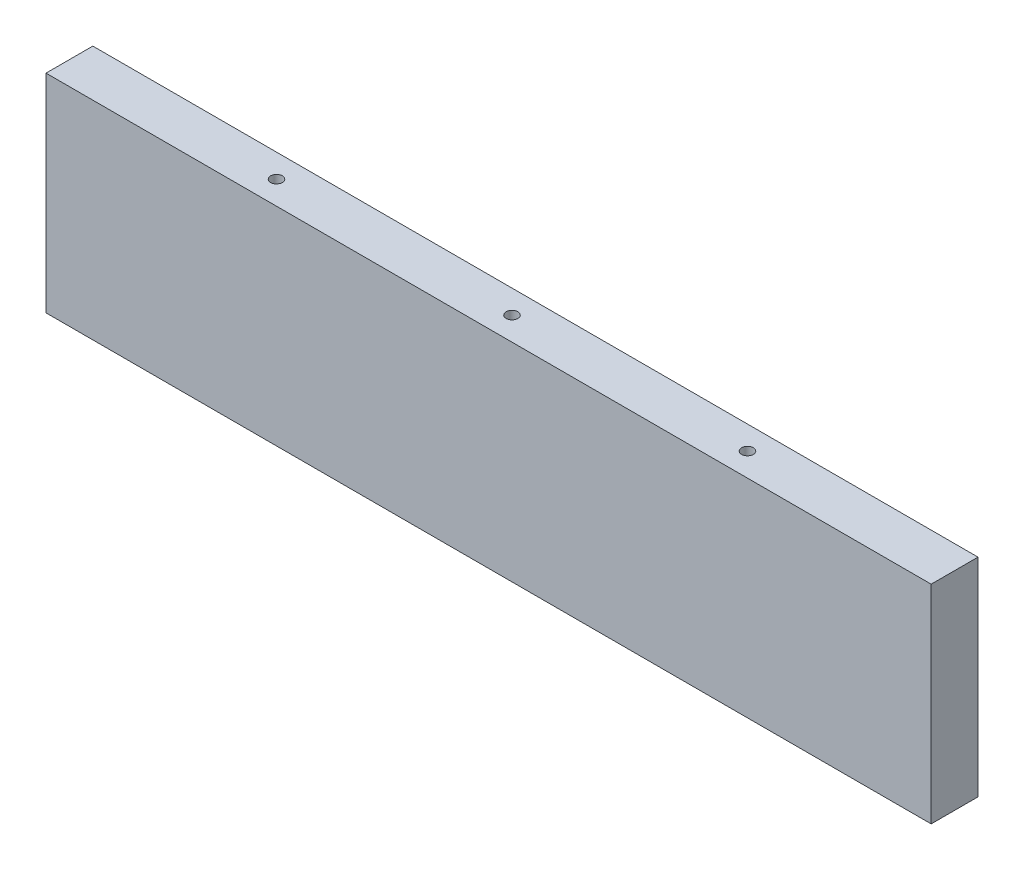
ISO-10303-21;
HEADER;
FILE_DESCRIPTION(('STEP AP214'),'2;1');
FILE_NAME('part.step','',(''),(''),'','','');
FILE_SCHEMA(('AUTOMOTIVE_DESIGN { 1 0 10303 214 1 1 1 1 }'));
ENDSEC;
DATA;
#1=APPLICATION_CONTEXT('core data for automotive mechanical design processes');
#2=APPLICATION_PROTOCOL_DEFINITION('international standard','automotive_design',2000,#1);
#3=PRODUCT_CONTEXT('',#1,'mechanical');
#4=PRODUCT('Part','Part','',(#3));
#5=PRODUCT_RELATED_PRODUCT_CATEGORY('part','',(#4));
#6=PRODUCT_DEFINITION_FORMATION('','',#4);
#7=PRODUCT_DEFINITION_CONTEXT('part definition',#1,'design');
#8=PRODUCT_DEFINITION('design','',#6,#7);
#9=PRODUCT_DEFINITION_SHAPE('','',#8);
#10=(LENGTH_UNIT() NAMED_UNIT(*) SI_UNIT(.MILLI.,.METRE.));
#11=(NAMED_UNIT(*) PLANE_ANGLE_UNIT() SI_UNIT($,.RADIAN.));
#12=(NAMED_UNIT(*) SI_UNIT($,.STERADIAN.) SOLID_ANGLE_UNIT());
#13=UNCERTAINTY_MEASURE_WITH_UNIT(LENGTH_MEASURE(1.E-05),#10,'distance_accuracy_value','');
#14=(GEOMETRIC_REPRESENTATION_CONTEXT(3) GLOBAL_UNCERTAINTY_ASSIGNED_CONTEXT((#13)) GLOBAL_UNIT_ASSIGNED_CONTEXT((#10,
#11,#12)) REPRESENTATION_CONTEXT('',''));
#15=CARTESIAN_POINT('',(0.,0.,0.));
#16=DIRECTION('',(0.,0.,1.));
#17=DIRECTION('',(1.,0.,0.));
#18=AXIS2_PLACEMENT_3D('',#15,#16,#17);
#19=CARTESIAN_POINT('',(-16.7044659751926,12.700000000003,-12.7000000000003));
#20=DIRECTION('',(0.,-1.00000000000006,0.));
#21=DIRECTION('',(1.,0.,0.));
#22=AXIS2_PLACEMENT_3D('',#19,#20,#21);
#23=PLANE('',#22);
#24=CARTESIAN_POINT('',(-29.4044659751927,12.7000000000036,-6.35000000000077));
#25=DIRECTION('',(0.,-1.00000000000006,0.));
#26=DIRECTION('',(1.,0.,0.));
#27=AXIS2_PLACEMENT_3D('',#24,#25,#26);
#28=CIRCLE('',#27,1.5875);
#29=CARTESIAN_POINT('',(-27.8169659751927,12.7000000000036,-6.35000000000077));
#30=VERTEX_POINT('',#29);
#31=EDGE_CURVE('E116',#30,#30,#28,.T.);
#32=ORIENTED_EDGE('',*,*,#31,.F.);
#33=EDGE_LOOP('',(#32));
#34=FACE_BOUND('',#33,.T.);
#35=CARTESIAN_POINT('',(-218.604465963193,12.7000000000018,-6.35000000000094));
#36=DIRECTION('',(0.,-1.00000000000006,0.));
#37=DIRECTION('',(1.,0.,0.));
#38=AXIS2_PLACEMENT_3D('',#35,#36,#37);
#39=CIRCLE('',#38,1.58749999999999);
#40=CARTESIAN_POINT('',(-217.016965963193,12.7000000000018,-6.35000000000094));
#41=VERTEX_POINT('',#40);
#42=EDGE_CURVE('E120',#41,#41,#39,.T.);
#43=ORIENTED_EDGE('',*,*,#42,.F.);
#44=EDGE_LOOP('',(#43));
#45=FACE_BOUND('',#44,.T.);
#46=CARTESIAN_POINT('',(-124.004465969193,12.7000000000032,-6.35000000000094));
#47=DIRECTION('',(0.,-1.00000000000006,0.));
#48=DIRECTION('',(1.,0.,0.));
#49=AXIS2_PLACEMENT_3D('',#46,#47,#48);
#50=CIRCLE('',#49,1.58750000000001);
#51=CARTESIAN_POINT('',(-122.416965969193,12.7000000000032,-6.35000000000094));
#52=VERTEX_POINT('',#51);
#53=EDGE_CURVE('E124',#52,#52,#50,.T.);
#54=ORIENTED_EDGE('',*,*,#53,.F.);
#55=EDGE_LOOP('',(#54));
#56=FACE_BOUND('',#55,.T.);
#57=DIRECTION('',(1.,0.,0.));
#58=VECTOR('',#57,1.);
#59=CARTESIAN_POINT('',(-16.7044659751926,12.7000000000026,-6.10622663543836E-13));
#60=LINE('',#59,#58);
#61=CARTESIAN_POINT('',(-244.004465963193,12.7000000000017,-1.38777878078145E-13));
#62=VERTEX_POINT('',#61);
#63=CARTESIAN_POINT('',(-4.00446597519265,12.7000000000024,4.71844785465692E-13));
#64=VERTEX_POINT('',#63);
#65=EDGE_CURVE('E148',#62,#64,#60,.T.);
#66=ORIENTED_EDGE('',*,*,#65,.F.);
#67=DIRECTION('',(0.,0.,1.00000000000003));
#68=VECTOR('',#67,1.);
#69=CARTESIAN_POINT('',(-244.004465963193,12.7000000000037,-12.7000000000013));
#70=LINE('',#69,#68);
#71=CARTESIAN_POINT('',(-244.004465963193,12.7000000000037,-12.7000000000013));
#72=VERTEX_POINT('',#71);
#73=EDGE_CURVE('E137',#72,#62,#70,.T.);
#74=ORIENTED_EDGE('',*,*,#73,.F.);
#75=DIRECTION('',(1.,0.,0.));
#76=VECTOR('',#75,1.);
#77=CARTESIAN_POINT('',(-16.7044659751926,12.700000000003,-12.7000000000003));
#78=LINE('',#77,#76);
#79=CARTESIAN_POINT('',(-4.00446597519256,12.7000000000029,-12.7000000000009));
#80=VERTEX_POINT('',#79);
#81=EDGE_CURVE('E11',#72,#80,#78,.T.);
#82=ORIENTED_EDGE('',*,*,#81,.T.);
#83=DIRECTION('',(0.,0.,-1.00000000000003));
#84=VECTOR('',#83,1.);
#85=CARTESIAN_POINT('',(-4.00446597519265,12.7000000000024,4.71844785465692E-13));
#86=LINE('',#85,#84);
#87=EDGE_CURVE('E131',#64,#80,#86,.T.);
#88=ORIENTED_EDGE('',*,*,#87,.F.);
#89=EDGE_LOOP('',(#66,#74,#82,#88));
#90=FACE_BOUND('',#89,.T.);
#91=ADVANCED_FACE('F34',(#34,#45,#56,#90),#23,.T.);
#92=CARTESIAN_POINT('',(-16.7044659751913,69.0000000000059,-12.699999999999));
#93=DIRECTION('',(0.,1.00000000000006,0.));
#94=DIRECTION('',(-1.,0.,0.));
#95=AXIS2_PLACEMENT_3D('',#92,#93,#94);
#96=PLANE('',#95);
#97=CARTESIAN_POINT('',(-60.1544659691935,69.0000000000064,-6.34999999999905));
#98=DIRECTION('',(0.,1.00000000000006,0.));
#99=DIRECTION('',(-1.,0.,0.));
#100=AXIS2_PLACEMENT_3D('',#97,#98,#99);
#101=CIRCLE('',#100,1.5875);
#102=CARTESIAN_POINT('',(-61.7419659691935,69.0000000000064,-6.34999999999905));
#103=VERTEX_POINT('',#102);
#104=EDGE_CURVE('E38',#103,#103,#101,.T.);
#105=ORIENTED_EDGE('',*,*,#104,.F.);
#106=EDGE_LOOP('',(#105));
#107=FACE_BOUND('',#106,.T.);
#108=CARTESIAN_POINT('',(-124.004465969193,69.0000000000067,-6.34999999999911));
#109=DIRECTION('',(0.,1.00000000000006,0.));
#110=DIRECTION('',(-1.,0.,0.));
#111=AXIS2_PLACEMENT_3D('',#108,#109,#110);
#112=CIRCLE('',#111,1.5875);
#113=CARTESIAN_POINT('',(-125.591965969193,69.0000000000067,-6.34999999999911));
#114=VERTEX_POINT('',#113);
#115=EDGE_CURVE('E108',#114,#114,#112,.T.);
#116=ORIENTED_EDGE('',*,*,#115,.F.);
#117=EDGE_LOOP('',(#116));
#118=FACE_BOUND('',#117,.T.);
#119=CARTESIAN_POINT('',(-187.854465969192,69.0000000000076,-6.34999999999927));
#120=DIRECTION('',(0.,1.00000000000006,0.));
#121=DIRECTION('',(-1.,0.,0.));
#122=AXIS2_PLACEMENT_3D('',#119,#120,#121);
#123=CIRCLE('',#122,1.58749999999999);
#124=CARTESIAN_POINT('',(-189.441965969192,69.0000000000076,-6.34999999999927));
#125=VERTEX_POINT('',#124);
#126=EDGE_CURVE('E112',#125,#125,#123,.T.);
#127=ORIENTED_EDGE('',*,*,#126,.F.);
#128=EDGE_LOOP('',(#127));
#129=FACE_BOUND('',#128,.T.);
#130=DIRECTION('',(-1.,0.,0.));
#131=VECTOR('',#130,1.);
#132=CARTESIAN_POINT('',(-16.7044659751914,69.0000000000061,2.02615701994091E-12));
#133=LINE('',#132,#131);
#134=CARTESIAN_POINT('',(-4.00446597519144,69.0000000000064,1.99840144432528E-12));
#135=VERTEX_POINT('',#134);
#136=CARTESIAN_POINT('',(-244.004465963193,69.0000000000068,1.80411241501588E-12));
#137=VERTEX_POINT('',#136);
#138=EDGE_CURVE('E147',#135,#137,#133,.T.);
#139=ORIENTED_EDGE('',*,*,#138,.F.);
#140=DIRECTION('',(0.,0.,1.00000000000003));
#141=VECTOR('',#140,1.);
#142=CARTESIAN_POINT('',(-4.00446597519139,69.0000000000063,-12.6999999999989));
#143=LINE('',#142,#141);
#144=CARTESIAN_POINT('',(-4.00446597519139,69.0000000000063,-12.6999999999989));
#145=VERTEX_POINT('',#144);
#146=EDGE_CURVE('E125',#145,#135,#143,.T.);
#147=ORIENTED_EDGE('',*,*,#146,.F.);
#148=DIRECTION('',(-1.,0.,0.));
#149=VECTOR('',#148,1.);
#150=CARTESIAN_POINT('',(-16.7044659751913,69.0000000000059,-12.699999999999));
#151=LINE('',#150,#149);
#152=CARTESIAN_POINT('',(-244.004465963193,69.0000000000068,-12.699999999999));
#153=VERTEX_POINT('',#152);
#154=EDGE_CURVE('E43',#145,#153,#151,.T.);
#155=ORIENTED_EDGE('',*,*,#154,.T.);
#156=DIRECTION('',(0.,0.,-1.00000000000003));
#157=VECTOR('',#156,1.);
#158=CARTESIAN_POINT('',(-244.004465963193,69.0000000000068,1.80411241501588E-12));
#159=LINE('',#158,#157);
#160=EDGE_CURVE('E143',#137,#153,#159,.T.);
#161=ORIENTED_EDGE('',*,*,#160,.F.);
#162=EDGE_LOOP('',(#139,#147,#155,#161));
#163=FACE_BOUND('',#162,.T.);
#164=ADVANCED_FACE('F36',(#107,#118,#129,#163),#96,.T.);
#165=CARTESIAN_POINT('',(0.,2.77555756156289E-13,-12.7000000000001));
#166=DIRECTION('',(0.,0.,1.00000000000003));
#167=DIRECTION('',(1.,0.,0.));
#168=AXIS2_PLACEMENT_3D('',#165,#166,#167);
#169=PLANE('',#168);
#170=ORIENTED_EDGE('',*,*,#154,.F.);
#171=DIRECTION('',(0.,1.00000000000006,0.));
#172=VECTOR('',#171,1.);
#173=CARTESIAN_POINT('',(-4.00446597519256,12.7000000000029,-12.7000000000009));
#174=LINE('',#173,#172);
#175=EDGE_CURVE('E134',#80,#145,#174,.T.);
#176=ORIENTED_EDGE('',*,*,#175,.F.);
#177=ORIENTED_EDGE('',*,*,#81,.F.);
#178=DIRECTION('',(0.,-1.00000000000006,0.));
#179=VECTOR('',#178,1.);
#180=CARTESIAN_POINT('',(-244.004465963193,69.0000000000068,-12.699999999999));
#181=LINE('',#180,#179);
#182=EDGE_CURVE('E145',#153,#72,#181,.T.);
#183=ORIENTED_EDGE('',*,*,#182,.F.);
#184=EDGE_LOOP('',(#170,#176,#177,#183));
#185=FACE_BOUND('',#184,.T.);
#186=ADVANCED_FACE('F166',(#185),#169,.F.);
#187=CARTESIAN_POINT('',(0.,0.,0.));
#188=DIRECTION('',(0.,0.,1.00000000000003));
#189=DIRECTION('',(1.,0.,0.));
#190=AXIS2_PLACEMENT_3D('',#187,#188,#189);
#191=PLANE('',#190);
#192=ORIENTED_EDGE('',*,*,#65,.T.);
#193=DIRECTION('',(0.,-1.00000000000006,0.));
#194=VECTOR('',#193,1.);
#195=CARTESIAN_POINT('',(-4.00446597519144,69.0000000000064,1.99840144432528E-12));
#196=LINE('',#195,#194);
#197=EDGE_CURVE('E128',#135,#64,#196,.T.);
#198=ORIENTED_EDGE('',*,*,#197,.F.);
#199=ORIENTED_EDGE('',*,*,#138,.T.);
#200=DIRECTION('',(0.,1.00000000000006,0.));
#201=VECTOR('',#200,1.);
#202=CARTESIAN_POINT('',(-244.004465963193,12.7000000000017,-1.38777878078145E-13));
#203=LINE('',#202,#201);
#204=EDGE_CURVE('E140',#62,#137,#203,.T.);
#205=ORIENTED_EDGE('',*,*,#204,.F.);
#206=EDGE_LOOP('',(#192,#198,#199,#205));
#207=FACE_BOUND('',#206,.T.);
#208=ADVANCED_FACE('F172',(#207),#191,.T.);
#209=CARTESIAN_POINT('',(-244.004465963193,-1.33226762955019E-12,-1.66533453693773E-13));
#210=DIRECTION('',(-1.,0.,0.));
#211=DIRECTION('',(0.,0.,1.00000000000003));
#212=AXIS2_PLACEMENT_3D('',#209,#210,#211);
#213=PLANE('',#212);
#214=ORIENTED_EDGE('',*,*,#73,.T.);
#215=ORIENTED_EDGE('',*,*,#204,.T.);
#216=ORIENTED_EDGE('',*,*,#160,.T.);
#217=ORIENTED_EDGE('',*,*,#182,.T.);
#218=EDGE_LOOP('',(#214,#215,#216,#217));
#219=FACE_BOUND('',#218,.T.);
#220=ADVANCED_FACE('F178',(#219),#213,.T.);
#221=CARTESIAN_POINT('',(-4.00446597519262,6.32827124036339E-12,-1.94289029309402E-13));
#222=DIRECTION('',(1.,0.,0.));
#223=DIRECTION('',(0.,0.,-1.00000000000003));
#224=AXIS2_PLACEMENT_3D('',#221,#222,#223);
#225=PLANE('',#224);
#226=ORIENTED_EDGE('',*,*,#146,.T.);
#227=ORIENTED_EDGE('',*,*,#197,.T.);
#228=ORIENTED_EDGE('',*,*,#87,.T.);
#229=ORIENTED_EDGE('',*,*,#175,.T.);
#230=EDGE_LOOP('',(#226,#227,#228,#229));
#231=FACE_BOUND('',#230,.T.);
#232=ADVANCED_FACE('F175',(#231),#225,.T.);
#233=CARTESIAN_POINT('',(-124.004465969194,31.7500000000034,-6.34999999999941));
#234=DIRECTION('',(0.,-1.00000000000006,0.));
#235=DIRECTION('',(0.,0.,-1.00000000000003));
#236=AXIS2_PLACEMENT_3D('',#233,#234,#235);
#237=CONICAL_SURFACE('',#236,1.58750000000001,1.02974425867666);
#238=CARTESIAN_POINT('',(-124.004465969193,32.7038662327102,-6.34999999999947));
#239=VERTEX_POINT('',#238);
#240=VERTEX_LOOP('',#239);
#241=FACE_BOUND('',#240,.T.);
#242=CARTESIAN_POINT('',(-124.004465969194,31.7500000000034,-6.34999999999941));
#243=DIRECTION('',(0.,-1.00000000000006,0.));
#244=DIRECTION('',(0.,0.,-1.00000000000003));
#245=AXIS2_PLACEMENT_3D('',#242,#243,#244);
#246=CIRCLE('',#245,1.58750000000001);
#247=CARTESIAN_POINT('',(-124.004465969194,31.7500000000033,-7.93749999999946));
#248=VERTEX_POINT('',#247);
#249=EDGE_CURVE('E121',#248,#248,#246,.T.);
#250=ORIENTED_EDGE('',*,*,#249,.T.);
#251=EDGE_LOOP('',(#250));
#252=FACE_BOUND('',#251,.T.);
#253=ADVANCED_FACE('F195',(#241,#252),#237,.F.);
#254=CARTESIAN_POINT('',(-124.004465969193,2.27595720048157E-12,-6.35000000000005));
#255=DIRECTION('',(0.,-1.00000000000006,0.));
#256=DIRECTION('',(0.,0.,-1.00000000000003));
#257=AXIS2_PLACEMENT_3D('',#254,#255,#256);
#258=CYLINDRICAL_SURFACE('',#257,1.58750000000001);
#259=ORIENTED_EDGE('',*,*,#53,.T.);
#260=EDGE_LOOP('',(#259));
#261=FACE_BOUND('',#260,.T.);
#262=ORIENTED_EDGE('',*,*,#249,.F.);
#263=EDGE_LOOP('',(#262));
#264=FACE_BOUND('',#263,.T.);
#265=ADVANCED_FACE('F198',(#261,#264),#258,.F.);
#266=CARTESIAN_POINT('',(-218.604465963193,31.7500000000036,-6.34999999999952));
#267=DIRECTION('',(0.,-1.00000000000006,0.));
#268=DIRECTION('',(0.,0.,-1.00000000000003));
#269=AXIS2_PLACEMENT_3D('',#266,#267,#268);
#270=CONICAL_SURFACE('',#269,1.58749999999999,1.02974425867665);
#271=CARTESIAN_POINT('',(-218.604465963193,32.7038662327104,-6.34999999999958));
#272=VERTEX_POINT('',#271);
#273=VERTEX_LOOP('',#272);
#274=FACE_BOUND('',#273,.T.);
#275=CARTESIAN_POINT('',(-218.604465963193,31.7500000000036,-6.34999999999952));
#276=DIRECTION('',(0.,-1.00000000000006,0.));
#277=DIRECTION('',(0.,0.,-1.00000000000003));
#278=AXIS2_PLACEMENT_3D('',#275,#276,#277);
#279=CIRCLE('',#278,1.58749999999999);
#280=CARTESIAN_POINT('',(-218.604465963193,31.7500000000035,-7.93749999999956));
#281=VERTEX_POINT('',#280);
#282=EDGE_CURVE('E117',#281,#281,#279,.T.);
#283=ORIENTED_EDGE('',*,*,#282,.T.);
#284=EDGE_LOOP('',(#283));
#285=FACE_BOUND('',#284,.T.);
#286=ADVANCED_FACE('F202',(#274,#285),#270,.F.);
#287=CARTESIAN_POINT('',(-218.604465963193,4.77395900588817E-12,-6.34999999999977));
#288=DIRECTION('',(0.,-1.00000000000006,0.));
#289=DIRECTION('',(0.,0.,-1.00000000000003));
#290=AXIS2_PLACEMENT_3D('',#287,#288,#289);
#291=CYLINDRICAL_SURFACE('',#290,1.58749999999999);
#292=ORIENTED_EDGE('',*,*,#42,.T.);
#293=EDGE_LOOP('',(#292));
#294=FACE_BOUND('',#293,.T.);
#295=ORIENTED_EDGE('',*,*,#282,.F.);
#296=EDGE_LOOP('',(#295));
#297=FACE_BOUND('',#296,.T.);
#298=ADVANCED_FACE('F206',(#294,#297),#291,.F.);
#299=CARTESIAN_POINT('',(-29.4044659751929,31.7500000000039,-6.34999999999938));
#300=DIRECTION('',(0.,-1.00000000000006,0.));
#301=DIRECTION('',(0.,0.,-1.00000000000003));
#302=AXIS2_PLACEMENT_3D('',#299,#300,#301);
#303=CONICAL_SURFACE('',#302,1.5875,1.02974425867666);
#304=CARTESIAN_POINT('',(-29.4044659751931,32.7038662327104,-6.34999999999938));
#305=VERTEX_POINT('',#304);
#306=VERTEX_LOOP('',#305);
#307=FACE_BOUND('',#306,.T.);
#308=CARTESIAN_POINT('',(-29.4044659751929,31.7500000000039,-6.34999999999938));
#309=DIRECTION('',(0.,-1.00000000000006,0.));
#310=DIRECTION('',(0.,0.,-1.00000000000003));
#311=AXIS2_PLACEMENT_3D('',#308,#309,#310);
#312=CIRCLE('',#311,1.5875);
#313=CARTESIAN_POINT('',(-29.4044659751929,31.7500000000039,-7.93749999999943));
#314=VERTEX_POINT('',#313);
#315=EDGE_CURVE('E113',#314,#314,#312,.T.);
#316=ORIENTED_EDGE('',*,*,#315,.T.);
#317=EDGE_LOOP('',(#316));
#318=FACE_BOUND('',#317,.T.);
#319=ADVANCED_FACE('F210',(#307,#318),#303,.F.);
#320=CARTESIAN_POINT('',(-29.4044659751927,0.,-6.34999999999994));
#321=DIRECTION('',(0.,-1.00000000000006,0.));
#322=DIRECTION('',(0.,0.,-1.00000000000003));
#323=AXIS2_PLACEMENT_3D('',#320,#321,#322);
#324=CYLINDRICAL_SURFACE('',#323,1.5875);
#325=ORIENTED_EDGE('',*,*,#31,.T.);
#326=EDGE_LOOP('',(#325));
#327=FACE_BOUND('',#326,.T.);
#328=ORIENTED_EDGE('',*,*,#315,.F.);
#329=EDGE_LOOP('',(#328));
#330=FACE_BOUND('',#329,.T.);
#331=ADVANCED_FACE('F214',(#327,#330),#324,.F.);
#332=CARTESIAN_POINT('',(-187.854465969192,56.3000000000061,-6.34999999999911));
#333=DIRECTION('',(0.,1.00000000000006,0.));
#334=DIRECTION('',(0.,0.,1.00000000000003));
#335=AXIS2_PLACEMENT_3D('',#332,#333,#334);
#336=CONICAL_SURFACE('',#335,1.58749999999999,1.02974425867665);
#337=CARTESIAN_POINT('',(-187.854465969192,55.3461337673002,-6.34999999999905));
#338=VERTEX_POINT('',#337);
#339=VERTEX_LOOP('',#338);
#340=FACE_BOUND('',#339,.T.);
#341=CARTESIAN_POINT('',(-187.854465969192,56.3000000000061,-6.34999999999911));
#342=DIRECTION('',(0.,1.00000000000006,0.));
#343=DIRECTION('',(0.,0.,1.00000000000003));
#344=AXIS2_PLACEMENT_3D('',#341,#342,#343);
#345=CIRCLE('',#344,1.58749999999999);
#346=CARTESIAN_POINT('',(-187.854465969192,56.3000000000062,-4.76249999999907));
#347=VERTEX_POINT('',#346);
#348=EDGE_CURVE('E109',#347,#347,#345,.T.);
#349=ORIENTED_EDGE('',*,*,#348,.T.);
#350=EDGE_LOOP('',(#349));
#351=FACE_BOUND('',#350,.T.);
#352=ADVANCED_FACE('F218',(#340,#351),#336,.F.);
#353=CARTESIAN_POINT('',(-187.854465969192,88.0500000000086,-6.3499999999983));
#354=DIRECTION('',(0.,1.00000000000006,0.));
#355=DIRECTION('',(0.,0.,1.00000000000003));
#356=AXIS2_PLACEMENT_3D('',#353,#354,#355);
#357=CYLINDRICAL_SURFACE('',#356,1.58749999999999);
#358=ORIENTED_EDGE('',*,*,#126,.T.);
#359=EDGE_LOOP('',(#358));
#360=FACE_BOUND('',#359,.T.);
#361=ORIENTED_EDGE('',*,*,#348,.F.);
#362=EDGE_LOOP('',(#361));
#363=FACE_BOUND('',#362,.T.);
#364=ADVANCED_FACE('F222',(#360,#363),#357,.F.);
#365=CARTESIAN_POINT('',(-124.004465969193,56.3000000000057,-6.34999999999883));
#366=DIRECTION('',(0.,1.00000000000006,0.));
#367=DIRECTION('',(0.,0.,1.00000000000003));
#368=AXIS2_PLACEMENT_3D('',#365,#366,#367);
#369=CONICAL_SURFACE('',#368,1.58749999999999,1.02974425867665);
#370=CARTESIAN_POINT('',(-124.004465969193,55.3461337672995,-6.34999999999866));
#371=VERTEX_POINT('',#370);
#372=VERTEX_LOOP('',#371);
#373=FACE_BOUND('',#372,.T.);
#374=CARTESIAN_POINT('',(-124.004465969193,56.3000000000057,-6.34999999999883));
#375=DIRECTION('',(0.,1.00000000000006,0.));
#376=DIRECTION('',(0.,0.,1.00000000000003));
#377=AXIS2_PLACEMENT_3D('',#374,#375,#376);
#378=CIRCLE('',#377,1.58749999999999);
#379=CARTESIAN_POINT('',(-124.004465969193,56.3000000000058,-4.76249999999879));
#380=VERTEX_POINT('',#379);
#381=EDGE_CURVE('E104',#380,#380,#378,.T.);
#382=ORIENTED_EDGE('',*,*,#381,.T.);
#383=EDGE_LOOP('',(#382));
#384=FACE_BOUND('',#383,.T.);
#385=ADVANCED_FACE('F226',(#373,#384),#369,.F.);
#386=CARTESIAN_POINT('',(-124.004465969193,88.0500000000083,-6.34999999999788));
#387=DIRECTION('',(0.,1.00000000000006,0.));
#388=DIRECTION('',(0.,0.,1.00000000000003));
#389=AXIS2_PLACEMENT_3D('',#386,#387,#388);
#390=CYLINDRICAL_SURFACE('',#389,1.5875);
#391=ORIENTED_EDGE('',*,*,#115,.T.);
#392=EDGE_LOOP('',(#391));
#393=FACE_BOUND('',#392,.T.);
#394=ORIENTED_EDGE('',*,*,#381,.F.);
#395=EDGE_LOOP('',(#394));
#396=FACE_BOUND('',#395,.T.);
#397=ADVANCED_FACE('F96',(#393,#396),#390,.F.);
#398=CARTESIAN_POINT('',(-60.1544659691936,56.3000000000055,-6.34999999999894));
#399=DIRECTION('',(0.,1.00000000000006,0.));
#400=DIRECTION('',(0.,0.,1.00000000000003));
#401=AXIS2_PLACEMENT_3D('',#398,#399,#400);
#402=CONICAL_SURFACE('',#401,1.5875,1.02974425867666);
#403=CARTESIAN_POINT('',(-60.1544659691935,55.3461337672994,-6.34999999999883));
#404=VERTEX_POINT('',#403);
#405=VERTEX_LOOP('',#404);
#406=FACE_BOUND('',#405,.T.);
#407=CARTESIAN_POINT('',(-60.1544659691936,56.3000000000055,-6.34999999999894));
#408=DIRECTION('',(0.,1.00000000000006,0.));
#409=DIRECTION('',(0.,0.,1.00000000000003));
#410=AXIS2_PLACEMENT_3D('',#407,#408,#409);
#411=CIRCLE('',#410,1.5875);
#412=CARTESIAN_POINT('',(-60.1544659691936,56.3000000000056,-4.7624999999989));
#413=VERTEX_POINT('',#412);
#414=EDGE_CURVE('E100',#413,#413,#411,.T.);
#415=ORIENTED_EDGE('',*,*,#414,.T.);
#416=EDGE_LOOP('',(#415));
#417=FACE_BOUND('',#416,.T.);
#418=ADVANCED_FACE('F92',(#406,#417),#402,.F.);
#419=CARTESIAN_POINT('',(-60.1544659691933,88.0500000000079,-6.34999999999794));
#420=DIRECTION('',(0.,1.00000000000006,0.));
#421=DIRECTION('',(0.,0.,1.00000000000003));
#422=AXIS2_PLACEMENT_3D('',#419,#420,#421);
#423=CYLINDRICAL_SURFACE('',#422,1.5875);
#424=ORIENTED_EDGE('',*,*,#104,.T.);
#425=EDGE_LOOP('',(#424));
#426=FACE_BOUND('',#425,.T.);
#427=ORIENTED_EDGE('',*,*,#414,.F.);
#428=EDGE_LOOP('',(#427));
#429=FACE_BOUND('',#428,.T.);
#430=ADVANCED_FACE('F95',(#426,#429),#423,.F.);
#431=CLOSED_SHELL('',(#91,#164,#186,#208,#220,#232,#253,#265,#286,#298,#319,#331,#352,#364,#385,
#397,#418,#430));
#432=MANIFOLD_SOLID_BREP('B2',#431);
#433=ADVANCED_BREP_SHAPE_REPRESENTATION('',(#18,#432),#14);
#434=SHAPE_DEFINITION_REPRESENTATION(#9,#433);
ENDSEC;
END-ISO-10303-21;
